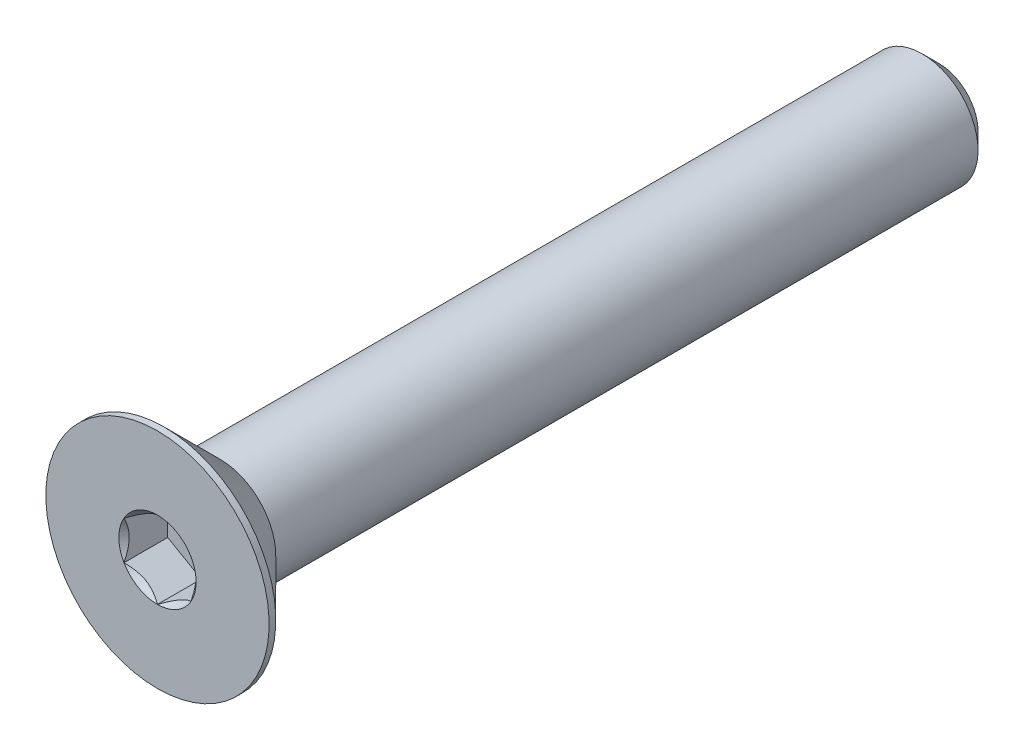
ISO-10303-21;
HEADER;
FILE_DESCRIPTION(('STEP AP214'),'2;1');
FILE_NAME('part.step','',(''),(''),'','','');
FILE_SCHEMA(('AUTOMOTIVE_DESIGN { 1 0 10303 214 1 1 1 1 }'));
ENDSEC;
DATA;
#1=APPLICATION_CONTEXT('core data for automotive mechanical design processes');
#2=APPLICATION_PROTOCOL_DEFINITION('international standard','automotive_design',2000,#1);
#3=PRODUCT_CONTEXT('',#1,'mechanical');
#4=PRODUCT('Part','Part','',(#3));
#5=PRODUCT_RELATED_PRODUCT_CATEGORY('part','',(#4));
#6=PRODUCT_DEFINITION_FORMATION('','',#4);
#7=PRODUCT_DEFINITION_CONTEXT('part definition',#1,'design');
#8=PRODUCT_DEFINITION('design','',#6,#7);
#9=PRODUCT_DEFINITION_SHAPE('','',#8);
#10=(LENGTH_UNIT() NAMED_UNIT(*) SI_UNIT(.MILLI.,.METRE.));
#11=(NAMED_UNIT(*) PLANE_ANGLE_UNIT() SI_UNIT($,.RADIAN.));
#12=(NAMED_UNIT(*) SI_UNIT($,.STERADIAN.) SOLID_ANGLE_UNIT());
#13=UNCERTAINTY_MEASURE_WITH_UNIT(LENGTH_MEASURE(1.E-05),#10,'distance_accuracy_value','');
#14=(GEOMETRIC_REPRESENTATION_CONTEXT(3) GLOBAL_UNCERTAINTY_ASSIGNED_CONTEXT((#13)) GLOBAL_UNIT_ASSIGNED_CONTEXT((#10,
#11,#12)) REPRESENTATION_CONTEXT('',''));
#15=CARTESIAN_POINT('',(0.,0.,0.));
#16=DIRECTION('',(0.,0.,1.));
#17=DIRECTION('',(1.,0.,0.));
#18=AXIS2_PLACEMENT_3D('',#15,#16,#17);
#19=CARTESIAN_POINT('',(0.,0.,-17.5));
#20=DIRECTION('',(0.,0.,-1.));
#21=DIRECTION('',(0.,1.,0.));
#22=AXIS2_PLACEMENT_3D('',#19,#20,#21);
#23=CYLINDRICAL_SURFACE('',#22,2.5);
#24=CARTESIAN_POINT('',(0.,0.,14.7));
#25=DIRECTION('',(0.,0.,-1.));
#26=DIRECTION('',(0.,1.,0.));
#27=AXIS2_PLACEMENT_3D('',#24,#25,#26);
#28=CIRCLE('',#27,2.5);
#29=CARTESIAN_POINT('',(0.,2.5,14.7));
#30=VERTEX_POINT('',#29);
#31=EDGE_CURVE('E11',#30,#30,#28,.F.);
#32=ORIENTED_EDGE('',*,*,#31,.F.);
#33=EDGE_LOOP('',(#32));
#34=FACE_BOUND('',#33,.T.);
#35=CARTESIAN_POINT('',(0.,0.,-16.75));
#36=DIRECTION('',(0.,0.,-1.));
#37=DIRECTION('',(0.,1.,0.));
#38=AXIS2_PLACEMENT_3D('',#35,#36,#37);
#39=CIRCLE('',#38,2.5);
#40=CARTESIAN_POINT('',(0.,2.5,-16.75));
#41=VERTEX_POINT('',#40);
#42=EDGE_CURVE('E43',#41,#41,#39,.F.);
#43=ORIENTED_EDGE('',*,*,#42,.T.);
#44=EDGE_LOOP('',(#43));
#45=FACE_BOUND('',#44,.T.);
#46=ADVANCED_FACE('F35',(#34,#45),#23,.T.);
#47=CARTESIAN_POINT('',(0.,2.5,-17.5));
#48=DIRECTION('',(0.,0.,-1.));
#49=DIRECTION('',(0.,1.,0.));
#50=AXIS2_PLACEMENT_3D('',#47,#48,#49);
#51=PLANE('',#50);
#52=CARTESIAN_POINT('',(0.,0.,-17.5));
#53=DIRECTION('',(0.,0.,-1.));
#54=DIRECTION('',(0.,1.,0.));
#55=AXIS2_PLACEMENT_3D('',#52,#53,#54);
#56=CIRCLE('',#55,1.75);
#57=CARTESIAN_POINT('',(0.,1.75,-17.5));
#58=VERTEX_POINT('',#57);
#59=EDGE_CURVE('E147',#58,#58,#56,.T.);
#60=ORIENTED_EDGE('',*,*,#59,.T.);
#61=EDGE_LOOP('',(#60));
#62=FACE_BOUND('',#61,.T.);
#63=ADVANCED_FACE('F156',(#62),#51,.T.);
#64=CARTESIAN_POINT('',(0.,0.,-17.5));
#65=DIRECTION('',(0.,0.,1.));
#66=DIRECTION('',(0.,-1.,0.));
#67=AXIS2_PLACEMENT_3D('',#64,#65,#66);
#68=CONICAL_SURFACE('',#67,1.75,0.785398163397448);
#69=ORIENTED_EDGE('',*,*,#42,.F.);
#70=EDGE_LOOP('',(#69));
#71=FACE_BOUND('',#70,.T.);
#72=ORIENTED_EDGE('',*,*,#59,.F.);
#73=EDGE_LOOP('',(#72));
#74=FACE_BOUND('',#73,.T.);
#75=ADVANCED_FACE('F37',(#71,#74),#68,.T.);
#76=CARTESIAN_POINT('',(0.,0.,-17.5));
#77=DIRECTION('',(0.,0.,-1.));
#78=DIRECTION('',(0.,1.,0.));
#79=AXIS2_PLACEMENT_3D('',#76,#77,#78);
#80=CYLINDRICAL_SURFACE('',#79,5.);
#81=CARTESIAN_POINT('',(0.,0.,17.5));
#82=DIRECTION('',(0.,0.,-1.));
#83=DIRECTION('',(0.,1.,0.));
#84=AXIS2_PLACEMENT_3D('',#81,#82,#83);
#85=CIRCLE('',#84,5.);
#86=CARTESIAN_POINT('',(0.,5.,17.5));
#87=VERTEX_POINT('',#86);
#88=EDGE_CURVE('E127',#87,#87,#85,.T.);
#89=ORIENTED_EDGE('',*,*,#88,.T.);
#90=EDGE_LOOP('',(#89));
#91=FACE_BOUND('',#90,.T.);
#92=CARTESIAN_POINT('',(0.,0.,17.2));
#93=DIRECTION('',(0.,0.,-1.));
#94=DIRECTION('',(0.,1.,0.));
#95=AXIS2_PLACEMENT_3D('',#92,#93,#94);
#96=CIRCLE('',#95,5.);
#97=CARTESIAN_POINT('',(0.,5.,17.2));
#98=VERTEX_POINT('',#97);
#99=EDGE_CURVE('E124',#98,#98,#96,.T.);
#100=ORIENTED_EDGE('',*,*,#99,.F.);
#101=EDGE_LOOP('',(#100));
#102=FACE_BOUND('',#101,.T.);
#103=ADVANCED_FACE('F155',(#91,#102),#80,.T.);
#104=CARTESIAN_POINT('',(0.,0.,14.7));
#105=DIRECTION('',(0.,0.,1.));
#106=DIRECTION('',(0.,-1.,0.));
#107=AXIS2_PLACEMENT_3D('',#104,#105,#106);
#108=CONICAL_SURFACE('',#107,2.5,0.78539816339745);
#109=ORIENTED_EDGE('',*,*,#99,.T.);
#110=EDGE_LOOP('',(#109));
#111=FACE_BOUND('',#110,.T.);
#112=ORIENTED_EDGE('',*,*,#31,.T.);
#113=EDGE_LOOP('',(#112));
#114=FACE_BOUND('',#113,.T.);
#115=ADVANCED_FACE('F169',(#111,#114),#108,.T.);
#116=CARTESIAN_POINT('',(0.,0.,17.5));
#117=DIRECTION('',(0.,0.,1.));
#118=DIRECTION('',(0.,-1.,0.));
#119=AXIS2_PLACEMENT_3D('',#116,#117,#118);
#120=PLANE('',#119);
#121=CARTESIAN_POINT('',(0.,0.,17.5));
#122=DIRECTION('',(0.,0.,1.));
#123=DIRECTION('',(1.,0.,0.));
#124=AXIS2_PLACEMENT_3D('',#121,#122,#123);
#125=CIRCLE('',#124,1.73205080756887);
#126=CARTESIAN_POINT('',(1.5,0.866025403784442,17.5));
#127=VERTEX_POINT('',#126);
#128=CARTESIAN_POINT('',(0.,1.73205080756888,17.5));
#129=VERTEX_POINT('',#128);
#130=EDGE_CURVE('E94',#127,#129,#125,.T.);
#131=ORIENTED_EDGE('',*,*,#130,.F.);
#132=CARTESIAN_POINT('',(0.,0.,17.5));
#133=DIRECTION('',(0.,0.,1.));
#134=DIRECTION('',(1.,0.,0.));
#135=AXIS2_PLACEMENT_3D('',#132,#133,#134);
#136=CIRCLE('',#135,1.73205080756887);
#137=CARTESIAN_POINT('',(1.49999999999999,-0.866025403784446,17.5));
#138=VERTEX_POINT('',#137);
#139=EDGE_CURVE('E106',#138,#127,#136,.T.);
#140=ORIENTED_EDGE('',*,*,#139,.F.);
#141=CARTESIAN_POINT('',(0.,0.,17.5));
#142=DIRECTION('',(0.,0.,1.));
#143=DIRECTION('',(1.,0.,0.));
#144=AXIS2_PLACEMENT_3D('',#141,#142,#143);
#145=CIRCLE('',#144,1.73205080756887);
#146=CARTESIAN_POINT('',(0.,-1.73205080756887,17.5));
#147=VERTEX_POINT('',#146);
#148=EDGE_CURVE('E240',#147,#138,#145,.T.);
#149=ORIENTED_EDGE('',*,*,#148,.F.);
#150=CARTESIAN_POINT('',(0.,0.,17.5));
#151=DIRECTION('',(0.,0.,1.));
#152=DIRECTION('',(1.,0.,0.));
#153=AXIS2_PLACEMENT_3D('',#150,#151,#152);
#154=CIRCLE('',#153,1.73205080756887);
#155=CARTESIAN_POINT('',(-1.5,-0.866025403784427,17.5));
#156=VERTEX_POINT('',#155);
#157=EDGE_CURVE('E119',#156,#147,#154,.T.);
#158=ORIENTED_EDGE('',*,*,#157,.F.);
#159=CARTESIAN_POINT('',(0.,0.,17.5));
#160=DIRECTION('',(0.,0.,1.));
#161=DIRECTION('',(1.,0.,0.));
#162=AXIS2_PLACEMENT_3D('',#159,#160,#161);
#163=CIRCLE('',#162,1.73205080756887);
#164=CARTESIAN_POINT('',(-1.5,0.866025403784439,17.5));
#165=VERTEX_POINT('',#164);
#166=EDGE_CURVE('E241',#165,#156,#163,.T.);
#167=ORIENTED_EDGE('',*,*,#166,.F.);
#168=CARTESIAN_POINT('',(0.,0.,17.5));
#169=DIRECTION('',(0.,0.,1.));
#170=DIRECTION('',(1.,0.,0.));
#171=AXIS2_PLACEMENT_3D('',#168,#169,#170);
#172=CIRCLE('',#171,1.73205080756887);
#173=EDGE_CURVE('E109',#129,#165,#172,.T.);
#174=ORIENTED_EDGE('',*,*,#173,.F.);
#175=EDGE_LOOP('',(#131,#140,#149,#158,#167,#174));
#176=FACE_BOUND('',#175,.T.);
#177=ORIENTED_EDGE('',*,*,#88,.F.);
#178=EDGE_LOOP('',(#177));
#179=FACE_BOUND('',#178,.T.);
#180=ADVANCED_FACE('F103',(#176,#179),#120,.T.);
#181=CARTESIAN_POINT('',(1.5,0.86602540378444,15.54));
#182=DIRECTION('',(0.5,0.866025403784438,0.));
#183=DIRECTION('',(-0.866025403784439,0.5,0.));
#184=AXIS2_PLACEMENT_3D('',#181,#182,#183);
#185=PLANE('',#184);
#186=DIRECTION('',(0.,0.,1.));
#187=VECTOR('',#186,1.);
#188=CARTESIAN_POINT('',(1.5,0.86602540378444,15.54));
#189=LINE('',#188,#187);
#190=CARTESIAN_POINT('',(1.5,0.86602540378444,15.54));
#191=VERTEX_POINT('',#190);
#192=EDGE_CURVE('E50',#191,#127,#189,.T.);
#193=ORIENTED_EDGE('',*,*,#192,.T.);
#194=CARTESIAN_POINT('',(-0.000200000000000169,1.73216627762272,17.5001154816001));
#195=CARTESIAN_POINT('',(0.0513677907370749,1.70239359975915,17.4703654760673));
#196=CARTESIAN_POINT('',(0.1037979176652,1.67212305186355,17.4423624839103));
#197=CARTESIAN_POINT('',(0.210709034055595,1.61039789003619,17.3910892304401));
#198=CARTESIAN_POINT('',(0.26520019581466,1.57893740312614,17.3678475050444));
#199=CARTESIAN_POINT('',(0.375079081357247,1.51549879897987,17.3280337289922));
#200=CARTESIAN_POINT('',(0.430438809095198,1.4835368452681,17.3113615856709));
#201=CARTESIAN_POINT('',(0.542377257477149,1.41890915196212,17.2856744568181));
#202=CARTESIAN_POINT('',(0.598952556553006,1.38624538781119,17.2766402904789));
#203=CARTESIAN_POINT('',(0.696455389516438,1.329952100953,17.2684890812268));
#204=CARTESIAN_POINT('',(0.737256908280463,1.30639533311124,17.2672822529892));
#205=CARTESIAN_POINT('',(0.818787969615855,1.25932335290194,17.2693140571623));
#206=CARTESIAN_POINT('',(0.859517494314626,1.23580815085314,17.2725536707483));
#207=CARTESIAN_POINT('',(0.940584402163413,1.18900414978427,17.283291985982));
#208=CARTESIAN_POINT('',(0.980921384598285,1.1657155821172,17.2907946530187));
#209=CARTESIAN_POINT('',(1.06091833691403,1.11952932016335,17.3096516119283));
#210=CARTESIAN_POINT('',(1.1005780085162,1.09663179808787,17.3210075570186));
#211=CARTESIAN_POINT('',(1.20216313477448,1.03798159809699,17.3547216475927));
#212=CARTESIAN_POINT('',(1.26345855370969,1.00259267147466,17.3796218490934));
#213=CARTESIAN_POINT('',(1.35358562846331,0.950557780604377,17.4216566532716));
#214=CARTESIAN_POINT('',(1.38328513990771,0.93341075967715,17.4364251535591));
#215=CARTESIAN_POINT('',(1.44213790138375,0.899432101996409,17.4673105659402));
#216=CARTESIAN_POINT('',(1.47129140422064,0.882600319285712,17.4834268341217));
#217=CARTESIAN_POINT('',(1.5002,0.865909933730602,17.5001154816001));
#218=B_SPLINE_CURVE_WITH_KNOTS('',3,(#194,#195,#196,#197,#198,#199,#200,#201,#202,#203,#204,
#205,#206,#207,#208,#209,#210,#211,#212,#213,#214,#215,#216,#217),.UNSPECIFIED.,.F.,.F.,(4,2,2,
2,2,2,2,2,2,2,2,4),(0.,0.199829143693304,0.400822987382388,0.598623720538181,0.795926240188887,
0.937113067959879,1.07833105577192,1.21968061668222,1.36109089931054,1.58570969637565,
1.69770705470963,1.80965120737194),.UNSPECIFIED.);
#219=EDGE_CURVE('E91',#129,#127,#218,.T.);
#220=ORIENTED_EDGE('',*,*,#219,.F.);
#221=DIRECTION('',(0.,0.,1.));
#222=VECTOR('',#221,1.);
#223=CARTESIAN_POINT('',(0.,1.73205080756888,15.54));
#224=LINE('',#223,#222);
#225=CARTESIAN_POINT('',(0.,1.73205080756888,15.54));
#226=VERTEX_POINT('',#225);
#227=EDGE_CURVE('E143',#226,#129,#224,.T.);
#228=ORIENTED_EDGE('',*,*,#227,.F.);
#229=DIRECTION('',(-0.866025403784439,0.5,0.));
#230=VECTOR('',#229,1.);
#231=CARTESIAN_POINT('',(1.5,0.86602540378444,15.54));
#232=LINE('',#231,#230);
#233=EDGE_CURVE('E116',#191,#226,#232,.T.);
#234=ORIENTED_EDGE('',*,*,#233,.F.);
#235=EDGE_LOOP('',(#193,#220,#228,#234));
#236=FACE_BOUND('',#235,.T.);
#237=ADVANCED_FACE('F121',(#236),#185,.F.);
#238=CARTESIAN_POINT('',(1.5,-0.86602540378444,15.54));
#239=DIRECTION('',(1.,0.,0.));
#240=DIRECTION('',(0.,0.,-1.));
#241=AXIS2_PLACEMENT_3D('',#238,#239,#240);
#242=PLANE('',#241);
#243=DIRECTION('',(0.,0.,1.));
#244=VECTOR('',#243,1.);
#245=CARTESIAN_POINT('',(1.5,-0.86602540378444,15.54));
#246=LINE('',#245,#244);
#247=CARTESIAN_POINT('',(1.5,-0.86602540378444,15.54));
#248=VERTEX_POINT('',#247);
#249=EDGE_CURVE('E58',#248,#138,#246,.T.);
#250=ORIENTED_EDGE('',*,*,#249,.T.);
#251=CARTESIAN_POINT('',(1.5,-1.72720812969693,18.0555785162708));
#252=CARTESIAN_POINT('',(1.5,-1.68515175699268,18.0238299078574));
#253=CARTESIAN_POINT('',(1.5,-1.64286104748674,17.9923925938074));
#254=CARTESIAN_POINT('',(1.5,-1.55771581035942,17.9302690875564));
#255=CARTESIAN_POINT('',(1.5,-1.51486114386669,17.8995830858922));
#256=CARTESIAN_POINT('',(1.5,-1.38468134151271,17.8084071924272));
#257=CARTESIAN_POINT('',(1.5,-1.29637976071654,17.7492883434268));
#258=CARTESIAN_POINT('',(1.5,-1.11121478730467,17.6332309963165));
#259=CARTESIAN_POINT('',(1.5,-1.01415038238167,17.576609558733));
#260=CARTESIAN_POINT('',(1.5,-0.815173408897605,17.4730368812657));
#261=CARTESIAN_POINT('',(1.5,-0.713278669253284,17.4260530415417));
#262=CARTESIAN_POINT('',(1.5,-0.56033377494311,17.3685726684308));
#263=CARTESIAN_POINT('',(1.5,-0.511547982948041,17.3520753877573));
#264=CARTESIAN_POINT('',(1.5,-0.412798620136865,17.322997512927));
#265=CARTESIAN_POINT('',(1.5,-0.362834968437561,17.310417188594));
#266=CARTESIAN_POINT('',(1.5,-0.262863235444979,17.2900361941468));
#267=CARTESIAN_POINT('',(1.5,-0.21287211380802,17.282153632746));
#268=CARTESIAN_POINT('',(1.5,-0.112355243569542,17.271322063969));
#269=CARTESIAN_POINT('',(1.5,-0.0618295883726246,17.2683722085244));
#270=CARTESIAN_POINT('',(1.5,0.0374291733323874,17.2676248577249));
#271=CARTESIAN_POINT('',(1.5,0.0861609672003023,17.2696447335581));
#272=CARTESIAN_POINT('',(1.5,0.18320693776883,17.2783225528968));
#273=CARTESIAN_POINT('',(1.5,0.231521073438272,17.2849809469685));
#274=CARTESIAN_POINT('',(1.5,0.328199853425439,17.3026852441226));
#275=CARTESIAN_POINT('',(1.5,0.376550616310332,17.313805811257));
#276=CARTESIAN_POINT('',(1.5,0.472195697125603,17.3398434140487));
#277=CARTESIAN_POINT('',(1.5,0.519490103092746,17.3547601320409));
#278=CARTESIAN_POINT('',(1.5,0.66839128269663,17.4073352235961));
#279=CARTESIAN_POINT('',(1.5,0.767878709508557,17.450981287472));
#280=CARTESIAN_POINT('',(1.5,0.962179866690727,17.5480229945931));
#281=CARTESIAN_POINT('',(1.5,1.05697519961444,17.6014536650895));
#282=CARTESIAN_POINT('',(1.5,1.23814273533383,17.7116858520046));
#283=CARTESIAN_POINT('',(1.5,1.3246994218129,17.7681879206986));
#284=CARTESIAN_POINT('',(1.5,1.45222331290674,17.8555343015787));
#285=CARTESIAN_POINT('',(1.5,1.49418091978756,17.88495775868));
#286=CARTESIAN_POINT('',(1.5,1.57752272931477,17.9445828218305));
#287=CARTESIAN_POINT('',(1.5,1.61890708647354,17.9747842116644));
#288=CARTESIAN_POINT('',(1.5,1.66005278019494,18.0053081786095));
#289=B_SPLINE_CURVE_WITH_KNOTS('',3,(#251,#252,#253,#254,#255,#256,#257,#258,#259,#260,#261,
#262,#263,#264,#265,#266,#267,#268,#269,#270,#271,#272,#273,#274,#275,#276,#277,#278,#279,#280,
#281,#282,#283,#284,#285,#286,#287,#288),.UNSPECIFIED.,.F.,.F.,(4,2,2,2,2,2,2,2,2,2,2,2,2,2,2,2,
2,2,4),(0.,0.158079548982669,0.316198780993943,0.634850417346961,0.971690311361515,
1.30737131660668,1.46173961127089,1.61611853740678,1.76772101421411,1.91929742368539,
2.06538741209601,2.21149159305545,2.36014984633873,2.50879566386711,2.83376031422674,
3.15991186985653,3.46985601802198,3.62358896039975,3.77727962642071),.UNSPECIFIED.);
#290=EDGE_CURVE('E115',#127,#138,#289,.F.);
#291=ORIENTED_EDGE('',*,*,#290,.F.);
#292=ORIENTED_EDGE('',*,*,#192,.F.);
#293=DIRECTION('',(0.,1.,0.));
#294=VECTOR('',#293,1.);
#295=CARTESIAN_POINT('',(1.5,-0.86602540378444,15.54));
#296=LINE('',#295,#294);
#297=EDGE_CURVE('E132',#248,#191,#296,.T.);
#298=ORIENTED_EDGE('',*,*,#297,.F.);
#299=EDGE_LOOP('',(#250,#291,#292,#298));
#300=FACE_BOUND('',#299,.T.);
#301=ADVANCED_FACE('F118',(#300),#242,.F.);
#302=CARTESIAN_POINT('',(0.,-1.73205080756888,15.54));
#303=DIRECTION('',(0.5,-0.866025403784439,0.));
#304=DIRECTION('',(0.866025403784439,0.5,0.));
#305=AXIS2_PLACEMENT_3D('',#302,#303,#304);
#306=PLANE('',#305);
#307=DIRECTION('',(0.,0.,1.));
#308=VECTOR('',#307,1.);
#309=CARTESIAN_POINT('',(0.,-1.73205080756888,15.54));
#310=LINE('',#309,#308);
#311=CARTESIAN_POINT('',(0.,-1.73205080756888,15.54));
#312=VERTEX_POINT('',#311);
#313=EDGE_CURVE('E129',#312,#147,#310,.T.);
#314=ORIENTED_EDGE('',*,*,#313,.T.);
#315=CARTESIAN_POINT('',(1.5002,-0.865909933730602,17.5001154816001));
#316=CARTESIAN_POINT('',(1.44863220926292,-0.895682611594167,17.4703654760673));
#317=CARTESIAN_POINT('',(1.3962020823348,-0.925953159489767,17.4423624839103));
#318=CARTESIAN_POINT('',(1.2892909659444,-0.987678321317125,17.3910892304402));
#319=CARTESIAN_POINT('',(1.23479980418534,-1.01913880822718,17.3678475050444));
#320=CARTESIAN_POINT('',(1.12492091864275,-1.08257741237344,17.3280337289922));
#321=CARTESIAN_POINT('',(1.0695611909048,-1.11453936608521,17.3113615856709));
#322=CARTESIAN_POINT('',(0.95762274252285,-1.1791670593912,17.2856744568181));
#323=CARTESIAN_POINT('',(0.901047443446992,-1.21183082354213,17.2766402904789));
#324=CARTESIAN_POINT('',(0.80354461048356,-1.26812411040032,17.2684890812269));
#325=CARTESIAN_POINT('',(0.762743091719535,-1.29168087824208,17.2672822529892));
#326=CARTESIAN_POINT('',(0.681212030384142,-1.33875285845138,17.2693140571623));
#327=CARTESIAN_POINT('',(0.640482505685371,-1.36226806050018,17.2725536707483));
#328=CARTESIAN_POINT('',(0.559415597836584,-1.40907206156905,17.283291985982));
#329=CARTESIAN_POINT('',(0.519078615401712,-1.43236062923612,17.2907946530187));
#330=CARTESIAN_POINT('',(0.439081663085969,-1.47854689118997,17.3096516119283));
#331=CARTESIAN_POINT('',(0.399421991483792,-1.50144441326545,17.3210075570186));
#332=CARTESIAN_POINT('',(0.297836865225515,-1.56009461325633,17.3547216475927));
#333=CARTESIAN_POINT('',(0.236541446290311,-1.59548353987866,17.3796218490934));
#334=CARTESIAN_POINT('',(0.146414371536686,-1.64751843074894,17.4216566532716));
#335=CARTESIAN_POINT('',(0.116714860092282,-1.66466545167617,17.4364251535591));
#336=CARTESIAN_POINT('',(0.0578620986162487,-1.69864410935691,17.4673105659402));
#337=CARTESIAN_POINT('',(0.0287085957793618,-1.71547589206761,17.4834268341217));
#338=CARTESIAN_POINT('',(-0.000200000000001471,-1.73216627762272,17.5001154816001));
#339=B_SPLINE_CURVE_WITH_KNOTS('',3,(#315,#316,#317,#318,#319,#320,#321,#322,#323,#324,#325,
#326,#327,#328,#329,#330,#331,#332,#333,#334,#335,#336,#337,#338),.UNSPECIFIED.,.F.,.F.,(4,2,2,
2,2,2,2,2,2,2,2,4),(0.,0.199829143693304,0.400822987382387,0.598623720538179,0.795926240188885,
0.937113067959878,1.07833105577193,1.21968061668222,1.36109089931054,1.58570969637565,
1.69770705470963,1.80965120737194),.UNSPECIFIED.);
#340=EDGE_CURVE('E238',#138,#147,#339,.T.);
#341=ORIENTED_EDGE('',*,*,#340,.F.);
#342=ORIENTED_EDGE('',*,*,#249,.F.);
#343=DIRECTION('',(0.866025403784439,0.5,0.));
#344=VECTOR('',#343,1.);
#345=CARTESIAN_POINT('',(0.,-1.73205080756888,15.54));
#346=LINE('',#345,#344);
#347=EDGE_CURVE('E230',#312,#248,#346,.T.);
#348=ORIENTED_EDGE('',*,*,#347,.F.);
#349=EDGE_LOOP('',(#314,#341,#342,#348));
#350=FACE_BOUND('',#349,.T.);
#351=ADVANCED_FACE('F194',(#350),#306,.F.);
#352=CARTESIAN_POINT('',(-1.5,-0.866025403784439,15.54));
#353=DIRECTION('',(-0.5,-0.866025403784438,0.));
#354=DIRECTION('',(0.866025403784439,-0.5,0.));
#355=AXIS2_PLACEMENT_3D('',#352,#353,#354);
#356=PLANE('',#355);
#357=DIRECTION('',(0.,0.,1.));
#358=VECTOR('',#357,1.);
#359=CARTESIAN_POINT('',(-1.5,-0.866025403784439,15.54));
#360=LINE('',#359,#358);
#361=CARTESIAN_POINT('',(-1.5,-0.866025403784439,15.54));
#362=VERTEX_POINT('',#361);
#363=EDGE_CURVE('E137',#362,#156,#360,.T.);
#364=ORIENTED_EDGE('',*,*,#363,.T.);
#365=CARTESIAN_POINT('',(0.000200000000000208,-1.73216627762272,17.5001154816001));
#366=CARTESIAN_POINT('',(-0.0513677907370753,-1.70239359975915,17.4703654760673));
#367=CARTESIAN_POINT('',(-0.1037979176652,-1.67212305186355,17.4423624839103));
#368=CARTESIAN_POINT('',(-0.210709034055596,-1.61039789003619,17.3910892304402));
#369=CARTESIAN_POINT('',(-0.265200195814661,-1.57893740312614,17.3678475050444));
#370=CARTESIAN_POINT('',(-0.375079081357248,-1.51549879897987,17.3280337289922));
#371=CARTESIAN_POINT('',(-0.430438809095199,-1.4835368452681,17.3113615856709));
#372=CARTESIAN_POINT('',(-0.542377257477151,-1.41890915196211,17.2856744568181));
#373=CARTESIAN_POINT('',(-0.59895255655301,-1.38624538781118,17.2766402904789));
#374=CARTESIAN_POINT('',(-0.696455389516442,-1.32995210095299,17.2684890812269));
#375=CARTESIAN_POINT('',(-0.737256908280468,-1.30639533311124,17.2672822529892));
#376=CARTESIAN_POINT('',(-0.81878796961586,-1.25932335290193,17.2693140571623));
#377=CARTESIAN_POINT('',(-0.859517494314632,-1.23580815085313,17.2725536707483));
#378=CARTESIAN_POINT('',(-0.940584402163418,-1.18900414978426,17.283291985982));
#379=CARTESIAN_POINT('',(-0.980921384598291,-1.16571558211719,17.2907946530187));
#380=CARTESIAN_POINT('',(-1.06091833691403,-1.11952932016335,17.3096516119283));
#381=CARTESIAN_POINT('',(-1.10057800851621,-1.09663179808786,17.3210075570186));
#382=CARTESIAN_POINT('',(-1.20216313477449,-1.03798159809698,17.3547216475927));
#383=CARTESIAN_POINT('',(-1.26345855370969,-1.00259267147465,17.3796218490934));
#384=CARTESIAN_POINT('',(-1.35358562846331,-0.950557780604375,17.4216566532716));
#385=CARTESIAN_POINT('',(-1.38328513990772,-0.933410759677148,17.4364251535591));
#386=CARTESIAN_POINT('',(-1.44213790138375,-0.899432101996408,17.4673105659402));
#387=CARTESIAN_POINT('',(-1.47129140422064,-0.882600319285711,17.4834268341217));
#388=CARTESIAN_POINT('',(-1.5002,-0.865909933730601,17.5001154816001));
#389=B_SPLINE_CURVE_WITH_KNOTS('',3,(#365,#366,#367,#368,#369,#370,#371,#372,#373,#374,#375,
#376,#377,#378,#379,#380,#381,#382,#383,#384,#385,#386,#387,#388),.UNSPECIFIED.,.F.,.F.,(4,2,2,
2,2,2,2,2,2,2,2,4),(0.,0.199829143693305,0.400822987382389,0.598623720538182,0.795926240188892,
0.937113067959884,1.07833105577193,1.21968061668222,1.36109089931055,1.58570969637566,
1.69770705470963,1.80965120737194),.UNSPECIFIED.);
#390=EDGE_CURVE('E212',#147,#156,#389,.T.);
#391=ORIENTED_EDGE('',*,*,#390,.F.);
#392=ORIENTED_EDGE('',*,*,#313,.F.);
#393=DIRECTION('',(0.866025403784438,-0.5,0.));
#394=VECTOR('',#393,1.);
#395=CARTESIAN_POINT('',(-1.5,-0.866025403784439,15.54));
#396=LINE('',#395,#394);
#397=EDGE_CURVE('E228',#362,#312,#396,.T.);
#398=ORIENTED_EDGE('',*,*,#397,.F.);
#399=EDGE_LOOP('',(#364,#391,#392,#398));
#400=FACE_BOUND('',#399,.T.);
#401=ADVANCED_FACE('F190',(#400),#356,.F.);
#402=CARTESIAN_POINT('',(-1.5,0.866025403784439,15.54));
#403=DIRECTION('',(-1.,0.,0.));
#404=DIRECTION('',(0.,-1.,0.));
#405=AXIS2_PLACEMENT_3D('',#402,#403,#404);
#406=PLANE('',#405);
#407=DIRECTION('',(0.,0.,1.));
#408=VECTOR('',#407,1.);
#409=CARTESIAN_POINT('',(-1.5,0.866025403784439,15.54));
#410=LINE('',#409,#408);
#411=CARTESIAN_POINT('',(-1.5,0.866025403784439,15.54));
#412=VERTEX_POINT('',#411);
#413=EDGE_CURVE('E140',#412,#165,#410,.T.);
#414=ORIENTED_EDGE('',*,*,#413,.T.);
#415=CARTESIAN_POINT('',(-1.5,-1.72720812969693,18.0555785162708));
#416=CARTESIAN_POINT('',(-1.5,-1.68515175699268,18.0238299078574));
#417=CARTESIAN_POINT('',(-1.5,-1.64286104748674,17.9923925938074));
#418=CARTESIAN_POINT('',(-1.5,-1.55771581035942,17.9302690875564));
#419=CARTESIAN_POINT('',(-1.5,-1.51486114386669,17.8995830858922));
#420=CARTESIAN_POINT('',(-1.5,-1.38468134151271,17.8084071924272));
#421=CARTESIAN_POINT('',(-1.5,-1.29637976071654,17.7492883434268));
#422=CARTESIAN_POINT('',(-1.5,-1.11121478730467,17.6332309963165));
#423=CARTESIAN_POINT('',(-1.5,-1.01415038238167,17.576609558733));
#424=CARTESIAN_POINT('',(-1.5,-0.815173408897605,17.4730368812657));
#425=CARTESIAN_POINT('',(-1.5,-0.713278669253283,17.4260530415417));
#426=CARTESIAN_POINT('',(-1.5,-0.560333774943109,17.3685726684308));
#427=CARTESIAN_POINT('',(-1.5,-0.51154798294804,17.3520753877573));
#428=CARTESIAN_POINT('',(-1.5,-0.412798620136864,17.322997512927));
#429=CARTESIAN_POINT('',(-1.5,-0.36283496843756,17.310417188594));
#430=CARTESIAN_POINT('',(-1.5,-0.262863235444979,17.2900361941468));
#431=CARTESIAN_POINT('',(-1.5,-0.212872113808019,17.282153632746));
#432=CARTESIAN_POINT('',(-1.5,-0.112355243569542,17.271322063969));
#433=CARTESIAN_POINT('',(-1.5,-0.0618295883726239,17.2683722085244));
#434=CARTESIAN_POINT('',(-1.5,0.0374291733323886,17.2676248577249));
#435=CARTESIAN_POINT('',(-1.5,0.0861609672003038,17.2696447335581));
#436=CARTESIAN_POINT('',(-1.5,0.183206937768832,17.2783225528968));
#437=CARTESIAN_POINT('',(-1.5,0.231521073438274,17.2849809469685));
#438=CARTESIAN_POINT('',(-1.5,0.328199853425441,17.3026852441226));
#439=CARTESIAN_POINT('',(-1.5,0.376550616310334,17.313805811257));
#440=CARTESIAN_POINT('',(-1.5,0.472195697125605,17.3398434140487));
#441=CARTESIAN_POINT('',(-1.5,0.519490103092747,17.3547601320409));
#442=CARTESIAN_POINT('',(-1.5,0.668391282696631,17.4073352235961));
#443=CARTESIAN_POINT('',(-1.5,0.767878709508559,17.450981287472));
#444=CARTESIAN_POINT('',(-1.5,0.96217986669073,17.5480229945931));
#445=CARTESIAN_POINT('',(-1.5,1.05697519961444,17.6014536650895));
#446=CARTESIAN_POINT('',(-1.5,1.23814273533383,17.7116858520046));
#447=CARTESIAN_POINT('',(-1.5,1.3246994218129,17.7681879206986));
#448=CARTESIAN_POINT('',(-1.5,1.45222331290674,17.8555343015787));
#449=CARTESIAN_POINT('',(-1.5,1.49418091978756,17.88495775868));
#450=CARTESIAN_POINT('',(-1.5,1.57752272931477,17.9445828218305));
#451=CARTESIAN_POINT('',(-1.5,1.61890708647355,17.9747842116644));
#452=CARTESIAN_POINT('',(-1.5,1.66005278019495,18.0053081786095));
#453=B_SPLINE_CURVE_WITH_KNOTS('',3,(#415,#416,#417,#418,#419,#420,#421,#422,#423,#424,#425,
#426,#427,#428,#429,#430,#431,#432,#433,#434,#435,#436,#437,#438,#439,#440,#441,#442,#443,#444,
#445,#446,#447,#448,#449,#450,#451,#452),.UNSPECIFIED.,.F.,.F.,(4,2,2,2,2,2,2,2,2,2,2,2,2,2,2,2,
2,2,4),(0.,0.158079548982669,0.316198780993943,0.63485041734696,0.971690311361514,
1.30737131660668,1.46173961127089,1.61611853740678,1.7677210142141,1.91929742368539,
2.06538741209601,2.21149159305545,2.36014984633874,2.50879566386711,2.83376031422674,
3.15991186985653,3.46985601802199,3.62358896039975,3.77727962642072),.UNSPECIFIED.);
#454=EDGE_CURVE('E97',#156,#165,#453,.T.);
#455=ORIENTED_EDGE('',*,*,#454,.F.);
#456=ORIENTED_EDGE('',*,*,#363,.F.);
#457=DIRECTION('',(0.,-1.,0.));
#458=VECTOR('',#457,1.);
#459=CARTESIAN_POINT('',(-1.5,0.866025403784439,15.54));
#460=LINE('',#459,#458);
#461=EDGE_CURVE('E225',#412,#362,#460,.T.);
#462=ORIENTED_EDGE('',*,*,#461,.F.);
#463=EDGE_LOOP('',(#414,#455,#456,#462));
#464=FACE_BOUND('',#463,.T.);
#465=ADVANCED_FACE('F186',(#464),#406,.F.);
#466=CARTESIAN_POINT('',(0.,1.73205080756888,15.54));
#467=DIRECTION('',(-0.5,0.866025403784439,0.));
#468=DIRECTION('',(-0.866025403784439,-0.5,0.));
#469=AXIS2_PLACEMENT_3D('',#466,#467,#468);
#470=PLANE('',#469);
#471=ORIENTED_EDGE('',*,*,#227,.T.);
#472=CARTESIAN_POINT('',(-1.5002,0.865909933730601,17.5001154816001));
#473=CARTESIAN_POINT('',(-1.44863220926293,0.895682611594166,17.4703654760673));
#474=CARTESIAN_POINT('',(-1.3962020823348,0.925953159489765,17.4423624839103));
#475=CARTESIAN_POINT('',(-1.28929096594441,0.987678321317123,17.3910892304401));
#476=CARTESIAN_POINT('',(-1.23479980418534,1.01913880822717,17.3678475050444));
#477=CARTESIAN_POINT('',(-1.12492091864275,1.08257741237344,17.3280337289922));
#478=CARTESIAN_POINT('',(-1.0695611909048,1.11453936608521,17.3113615856709));
#479=CARTESIAN_POINT('',(-0.957622742522851,1.1791670593912,17.2856744568181));
#480=CARTESIAN_POINT('',(-0.901047443446993,1.21183082354213,17.2766402904789));
#481=CARTESIAN_POINT('',(-0.80354461048356,1.26812411040032,17.2684890812268));
#482=CARTESIAN_POINT('',(-0.762743091719535,1.29168087824208,17.2672822529892));
#483=CARTESIAN_POINT('',(-0.681212030384143,1.33875285845138,17.2693140571623));
#484=CARTESIAN_POINT('',(-0.640482505685372,1.36226806050018,17.2725536707483));
#485=CARTESIAN_POINT('',(-0.559415597836586,1.40907206156905,17.283291985982));
#486=CARTESIAN_POINT('',(-0.519078615401714,1.43236062923612,17.2907946530187));
#487=CARTESIAN_POINT('',(-0.439081663085972,1.47854689118996,17.3096516119283));
#488=CARTESIAN_POINT('',(-0.399421991483795,1.50144441326545,17.3210075570186));
#489=CARTESIAN_POINT('',(-0.297836865225517,1.56009461325633,17.3547216475927));
#490=CARTESIAN_POINT('',(-0.236541446290313,1.59548353987866,17.3796218490934));
#491=CARTESIAN_POINT('',(-0.146414371536688,1.64751843074894,17.4216566532716));
#492=CARTESIAN_POINT('',(-0.116714860092283,1.66466545167617,17.4364251535591));
#493=CARTESIAN_POINT('',(-0.0578620986162493,1.69864410935691,17.4673105659402));
#494=CARTESIAN_POINT('',(-0.0287085957793629,1.71547589206761,17.4834268341217));
#495=CARTESIAN_POINT('',(0.000199999999999689,1.73216627762272,17.5001154816001));
#496=B_SPLINE_CURVE_WITH_KNOTS('',3,(#472,#473,#474,#475,#476,#477,#478,#479,#480,#481,#482,
#483,#484,#485,#486,#487,#488,#489,#490,#491,#492,#493,#494,#495),.UNSPECIFIED.,.F.,.F.,(4,2,2,
2,2,2,2,2,2,2,2,4),(0.,0.199829143693304,0.400822987382388,0.598623720538181,0.79592624018889,
0.937113067959882,1.07833105577193,1.21968061668222,1.36109089931054,1.58570969637565,
1.69770705470964,1.80965120737194),.UNSPECIFIED.);
#497=EDGE_CURVE('E234',#165,#129,#496,.T.);
#498=ORIENTED_EDGE('',*,*,#497,.F.);
#499=ORIENTED_EDGE('',*,*,#413,.F.);
#500=DIRECTION('',(-0.866025403784439,-0.5,0.));
#501=VECTOR('',#500,1.);
#502=CARTESIAN_POINT('',(0.,1.73205080756888,15.54));
#503=LINE('',#502,#501);
#504=EDGE_CURVE('E222',#226,#412,#503,.T.);
#505=ORIENTED_EDGE('',*,*,#504,.F.);
#506=EDGE_LOOP('',(#471,#498,#499,#505));
#507=FACE_BOUND('',#506,.T.);
#508=ADVANCED_FACE('F182',(#507),#470,.F.);
#509=CARTESIAN_POINT('',(0.,0.,15.54));
#510=DIRECTION('',(0.,0.,1.));
#511=DIRECTION('',(1.,0.,0.));
#512=AXIS2_PLACEMENT_3D('',#509,#510,#511);
#513=PLANE('',#512);
#514=ORIENTED_EDGE('',*,*,#233,.T.);
#515=ORIENTED_EDGE('',*,*,#504,.T.);
#516=ORIENTED_EDGE('',*,*,#461,.T.);
#517=ORIENTED_EDGE('',*,*,#397,.T.);
#518=ORIENTED_EDGE('',*,*,#347,.T.);
#519=ORIENTED_EDGE('',*,*,#297,.T.);
#520=EDGE_LOOP('',(#514,#515,#516,#517,#518,#519));
#521=FACE_BOUND('',#520,.T.);
#522=ADVANCED_FACE('F185',(#521),#513,.T.);
#523=CARTESIAN_POINT('',(0.,0.,17.5));
#524=DIRECTION('',(0.,0.,1.));
#525=DIRECTION('',(1.,0.,0.));
#526=AXIS2_PLACEMENT_3D('',#523,#524,#525);
#527=CONICAL_SURFACE('',#526,1.73205080756887,0.78539816339745);
#528=ORIENTED_EDGE('',*,*,#497,.T.);
#529=ORIENTED_EDGE('',*,*,#173,.T.);
#530=EDGE_LOOP('',(#528,#529));
#531=FACE_BOUND('',#530,.T.);
#532=ADVANCED_FACE('F202',(#531),#527,.F.);
#533=CARTESIAN_POINT('',(0.,0.,17.5));
#534=DIRECTION('',(0.,0.,1.));
#535=DIRECTION('',(1.,0.,0.));
#536=AXIS2_PLACEMENT_3D('',#533,#534,#535);
#537=CONICAL_SURFACE('',#536,1.73205080756887,0.78539816339745);
#538=ORIENTED_EDGE('',*,*,#390,.T.);
#539=ORIENTED_EDGE('',*,*,#157,.T.);
#540=EDGE_LOOP('',(#538,#539));
#541=FACE_BOUND('',#540,.T.);
#542=ADVANCED_FACE('F204',(#541),#537,.F.);
#543=CARTESIAN_POINT('',(0.,0.,17.5));
#544=DIRECTION('',(0.,0.,1.));
#545=DIRECTION('',(1.,0.,0.));
#546=AXIS2_PLACEMENT_3D('',#543,#544,#545);
#547=CONICAL_SURFACE('',#546,1.73205080756887,0.78539816339745);
#548=ORIENTED_EDGE('',*,*,#290,.T.);
#549=ORIENTED_EDGE('',*,*,#139,.T.);
#550=EDGE_LOOP('',(#548,#549));
#551=FACE_BOUND('',#550,.T.);
#552=ADVANCED_FACE('F114',(#551),#547,.F.);
#553=CARTESIAN_POINT('',(0.,0.,17.5));
#554=DIRECTION('',(0.,0.,1.));
#555=DIRECTION('',(1.,0.,0.));
#556=AXIS2_PLACEMENT_3D('',#553,#554,#555);
#557=CONICAL_SURFACE('',#556,1.73205080756887,0.78539816339745);
#558=ORIENTED_EDGE('',*,*,#340,.T.);
#559=ORIENTED_EDGE('',*,*,#148,.T.);
#560=EDGE_LOOP('',(#558,#559));
#561=FACE_BOUND('',#560,.T.);
#562=ADVANCED_FACE('F253',(#561),#557,.F.);
#563=CARTESIAN_POINT('',(0.,0.,17.5));
#564=DIRECTION('',(0.,0.,1.));
#565=DIRECTION('',(1.,0.,0.));
#566=AXIS2_PLACEMENT_3D('',#563,#564,#565);
#567=CONICAL_SURFACE('',#566,1.73205080756887,0.78539816339745);
#568=ORIENTED_EDGE('',*,*,#454,.T.);
#569=ORIENTED_EDGE('',*,*,#166,.T.);
#570=EDGE_LOOP('',(#568,#569));
#571=FACE_BOUND('',#570,.T.);
#572=ADVANCED_FACE('F258',(#571),#567,.F.);
#573=CARTESIAN_POINT('',(0.,0.,17.5));
#574=DIRECTION('',(0.,0.,1.));
#575=DIRECTION('',(1.,0.,0.));
#576=AXIS2_PLACEMENT_3D('',#573,#574,#575);
#577=CONICAL_SURFACE('',#576,1.73205080756887,0.78539816339745);
#578=ORIENTED_EDGE('',*,*,#219,.T.);
#579=ORIENTED_EDGE('',*,*,#130,.T.);
#580=EDGE_LOOP('',(#578,#579));
#581=FACE_BOUND('',#580,.T.);
#582=ADVANCED_FACE('F93',(#581),#577,.F.);
#583=CLOSED_SHELL('',(#46,#63,#75,#103,#115,#180,#237,#301,#351,#401,#465,#508,#522,#532,#542,
#552,#562,#572,#582));
#584=MANIFOLD_SOLID_BREP('B2',#583);
#585=ADVANCED_BREP_SHAPE_REPRESENTATION('',(#18,#584),#14);
#586=SHAPE_DEFINITION_REPRESENTATION(#9,#585);
ENDSEC;
END-ISO-10303-21;
